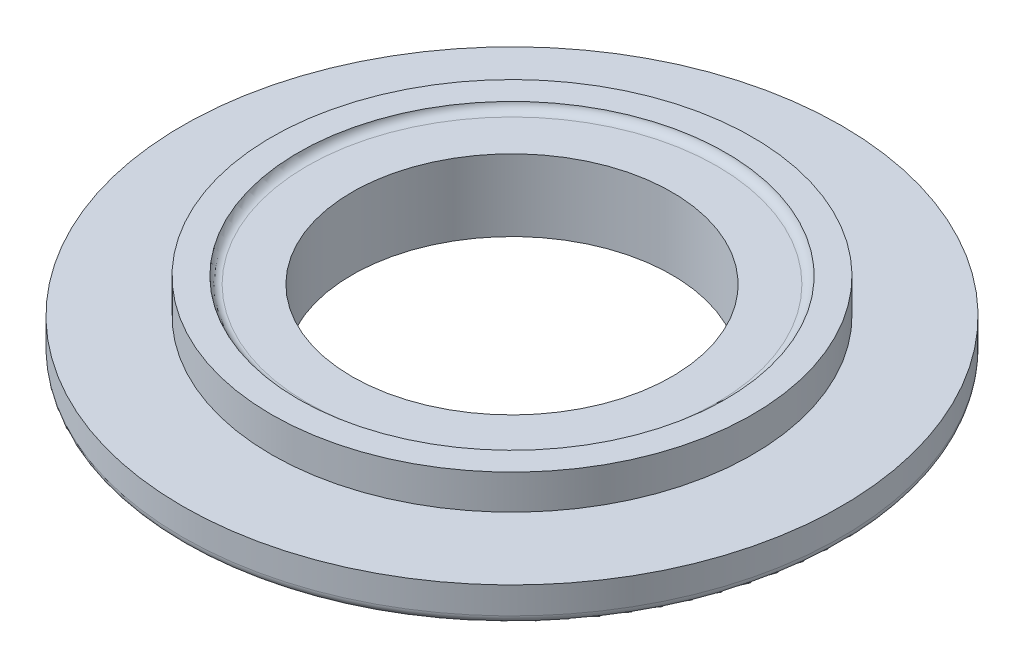
ISO-10303-21;
HEADER;
FILE_DESCRIPTION(('STEP AP214'),'2;1');
FILE_NAME('part.step','',(''),(''),'','','');
FILE_SCHEMA(('AUTOMOTIVE_DESIGN { 1 0 10303 214 1 1 1 1 }'));
ENDSEC;
DATA;
#1=APPLICATION_CONTEXT('core data for automotive mechanical design processes');
#2=APPLICATION_PROTOCOL_DEFINITION('international standard','automotive_design',2000,#1);
#3=PRODUCT_CONTEXT('',#1,'mechanical');
#4=PRODUCT('Part','Part','',(#3));
#5=PRODUCT_RELATED_PRODUCT_CATEGORY('part','',(#4));
#6=PRODUCT_DEFINITION_FORMATION('','',#4);
#7=PRODUCT_DEFINITION_CONTEXT('part definition',#1,'design');
#8=PRODUCT_DEFINITION('design','',#6,#7);
#9=PRODUCT_DEFINITION_SHAPE('','',#8);
#10=(LENGTH_UNIT() NAMED_UNIT(*) SI_UNIT(.MILLI.,.METRE.));
#11=(NAMED_UNIT(*) PLANE_ANGLE_UNIT() SI_UNIT($,.RADIAN.));
#12=(NAMED_UNIT(*) SI_UNIT($,.STERADIAN.) SOLID_ANGLE_UNIT());
#13=UNCERTAINTY_MEASURE_WITH_UNIT(LENGTH_MEASURE(1.E-05),#10,'distance_accuracy_value','');
#14=(GEOMETRIC_REPRESENTATION_CONTEXT(3) GLOBAL_UNCERTAINTY_ASSIGNED_CONTEXT((#13)) GLOBAL_UNIT_ASSIGNED_CONTEXT((#10,
#11,#12)) REPRESENTATION_CONTEXT('',''));
#15=CARTESIAN_POINT('',(0.,0.,0.));
#16=DIRECTION('',(0.,0.,1.));
#17=DIRECTION('',(1.,0.,0.));
#18=AXIS2_PLACEMENT_3D('',#15,#16,#17);
#19=CARTESIAN_POINT('',(0.,-0.827200395577673,0.));
#20=DIRECTION('',(0.,-1.,0.));
#21=DIRECTION('',(0.,0.,-1.));
#22=AXIS2_PLACEMENT_3D('',#19,#20,#21);
#23=PLANE('',#22);
#24=CARTESIAN_POINT('',(38.3060922527579,-0.827200395577673,0.));
#25=DIRECTION('',(0.,-1.,0.));
#26=DIRECTION('',(0.,0.,-1.));
#27=AXIS2_PLACEMENT_3D('',#24,#25,#26);
#28=CIRCLE('',#27,39.741899614486);
#29=CARTESIAN_POINT('',(38.3060922527579,-0.827200395577673,-39.741899614486));
#30=VERTEX_POINT('',#29);
#31=EDGE_CURVE('E51',#30,#30,#28,.F.);
#32=ORIENTED_EDGE('',*,*,#31,.T.);
#33=EDGE_LOOP('',(#32));
#34=FACE_BOUND('',#33,.T.);
#35=CARTESIAN_POINT('',(38.3060922527579,-0.827200395577673,0.));
#36=DIRECTION('',(0.,1.,0.));
#37=DIRECTION('',(0.,0.,1.));
#38=AXIS2_PLACEMENT_3D('',#35,#36,#37);
#39=CIRCLE('',#38,31.);
#40=CARTESIAN_POINT('',(38.3060922527579,-0.827200395577673,31.));
#41=VERTEX_POINT('',#40);
#42=EDGE_CURVE('E94',#41,#41,#39,.T.);
#43=ORIENTED_EDGE('',*,*,#42,.F.);
#44=EDGE_LOOP('',(#43));
#45=FACE_BOUND('',#44,.T.);
#46=ADVANCED_FACE('F38',(#34,#45),#23,.F.);
#47=CARTESIAN_POINT('',(0.,0.60267074625998,0.));
#48=DIRECTION('',(0.,-1.,0.));
#49=DIRECTION('',(0.,0.,-1.));
#50=AXIS2_PLACEMENT_3D('',#47,#48,#49);
#51=PLANE('',#50);
#52=CARTESIAN_POINT('',(38.3060922527579,0.60267074625998,0.));
#53=DIRECTION('',(0.,1.,0.));
#54=DIRECTION('',(0.,0.,1.));
#55=AXIS2_PLACEMENT_3D('',#52,#53,#54);
#56=CIRCLE('',#55,41.4203007584286);
#57=CARTESIAN_POINT('',(38.3060922527579,0.60267074625998,41.4203007584286));
#58=VERTEX_POINT('',#57);
#59=EDGE_CURVE('E56',#58,#58,#56,.T.);
#60=ORIENTED_EDGE('',*,*,#59,.F.);
#61=EDGE_LOOP('',(#60));
#62=FACE_BOUND('',#61,.T.);
#63=CARTESIAN_POINT('',(38.3060922527579,0.60267074625998,0.));
#64=DIRECTION('',(0.,1.,0.));
#65=DIRECTION('',(0.,0.,1.));
#66=AXIS2_PLACEMENT_3D('',#63,#64,#65);
#67=CIRCLE('',#66,46.6086903302396);
#68=CARTESIAN_POINT('',(38.3060922527579,0.60267074625998,46.6086903302396));
#69=VERTEX_POINT('',#68);
#70=EDGE_CURVE('E62',#69,#69,#67,.T.);
#71=ORIENTED_EDGE('',*,*,#70,.T.);
#72=EDGE_LOOP('',(#71));
#73=FACE_BOUND('',#72,.T.);
#74=ADVANCED_FACE('F102',(#62,#73),#51,.F.);
#75=CARTESIAN_POINT('',(38.3060922527579,0.60267074625998,0.));
#76=DIRECTION('',(0.,1.,0.));
#77=DIRECTION('',(0.,0.,1.));
#78=AXIS2_PLACEMENT_3D('',#75,#76,#77);
#79=CYLINDRICAL_SURFACE('',#78,46.6086903302396);
#80=ORIENTED_EDGE('',*,*,#70,.F.);
#81=EDGE_LOOP('',(#80));
#82=FACE_BOUND('',#81,.T.);
#83=CARTESIAN_POINT('',(38.3060922527579,-6.12065782810794,0.));
#84=DIRECTION('',(0.,1.,0.));
#85=DIRECTION('',(0.,0.,1.));
#86=AXIS2_PLACEMENT_3D('',#83,#84,#85);
#87=CIRCLE('',#86,46.6086903302396);
#88=CARTESIAN_POINT('',(38.3060922527579,-6.12065782810794,46.6086903302396));
#89=VERTEX_POINT('',#88);
#90=EDGE_CURVE('E66',#89,#89,#87,.T.);
#91=ORIENTED_EDGE('',*,*,#90,.T.);
#92=EDGE_LOOP('',(#91));
#93=FACE_BOUND('',#92,.T.);
#94=ADVANCED_FACE('F108',(#82,#93),#79,.T.);
#95=CARTESIAN_POINT('',(0.,-6.12065782810794,0.));
#96=DIRECTION('',(0.,-1.,0.));
#97=DIRECTION('',(0.,0.,-1.));
#98=AXIS2_PLACEMENT_3D('',#95,#96,#97);
#99=PLANE('',#98);
#100=ORIENTED_EDGE('',*,*,#90,.F.);
#101=EDGE_LOOP('',(#100));
#102=FACE_BOUND('',#101,.T.);
#103=CARTESIAN_POINT('',(38.3060922527579,-6.12065782810794,0.));
#104=DIRECTION('',(0.,1.,0.));
#105=DIRECTION('',(0.,0.,1.));
#106=AXIS2_PLACEMENT_3D('',#103,#104,#105);
#107=CIRCLE('',#106,63.8897044158775);
#108=CARTESIAN_POINT('',(38.3060922527579,-6.12065782810794,63.8897044158775));
#109=VERTEX_POINT('',#108);
#110=EDGE_CURVE('E70',#109,#109,#107,.T.);
#111=ORIENTED_EDGE('',*,*,#110,.T.);
#112=EDGE_LOOP('',(#111));
#113=FACE_BOUND('',#112,.T.);
#114=ADVANCED_FACE('F131',(#102,#113),#99,.F.);
#115=CARTESIAN_POINT('',(38.3060922527579,0.60267074625998,0.));
#116=DIRECTION('',(0.,1.,0.));
#117=DIRECTION('',(0.,0.,1.));
#118=AXIS2_PLACEMENT_3D('',#115,#116,#117);
#119=CYLINDRICAL_SURFACE('',#118,63.8897044158775);
#120=CARTESIAN_POINT('',(38.3060922527579,-11.3206578281079,0.));
#121=DIRECTION('',(0.,1.,0.));
#122=DIRECTION('',(0.,0.,1.));
#123=AXIS2_PLACEMENT_3D('',#120,#121,#122);
#124=CIRCLE('',#123,63.8897044158775);
#125=CARTESIAN_POINT('',(38.3060922527579,-11.3206578281079,63.8897044158775));
#126=VERTEX_POINT('',#125);
#127=EDGE_CURVE('E46',#126,#126,#124,.T.);
#128=ORIENTED_EDGE('',*,*,#127,.T.);
#129=EDGE_LOOP('',(#128));
#130=FACE_BOUND('',#129,.T.);
#131=ORIENTED_EDGE('',*,*,#110,.F.);
#132=EDGE_LOOP('',(#131));
#133=FACE_BOUND('',#132,.T.);
#134=ADVANCED_FACE('F136',(#130,#133),#119,.T.);
#135=CARTESIAN_POINT('',(0.,-13.0206578281079,0.));
#136=DIRECTION('',(0.,1.,0.));
#137=DIRECTION('',(0.,0.,1.));
#138=AXIS2_PLACEMENT_3D('',#135,#136,#137);
#139=PLANE('',#138);
#140=CARTESIAN_POINT('',(38.3060922527579,-13.0206578281079,0.));
#141=DIRECTION('',(0.,1.,0.));
#142=DIRECTION('',(0.,0.,1.));
#143=AXIS2_PLACEMENT_3D('',#140,#141,#142);
#144=CIRCLE('',#143,62.1897044158775);
#145=CARTESIAN_POINT('',(38.3060922527579,-13.0206578281079,62.1897044158775));
#146=VERTEX_POINT('',#145);
#147=EDGE_CURVE('E10',#146,#146,#144,.F.);
#148=ORIENTED_EDGE('',*,*,#147,.T.);
#149=EDGE_LOOP('',(#148));
#150=FACE_BOUND('',#149,.T.);
#151=CARTESIAN_POINT('',(38.3060922527579,-13.0206578281079,0.));
#152=DIRECTION('',(0.,1.,0.));
#153=DIRECTION('',(0.,0.,1.));
#154=AXIS2_PLACEMENT_3D('',#151,#152,#153);
#155=CIRCLE('',#154,39.8678692330049);
#156=CARTESIAN_POINT('',(38.3060922527579,-13.0206578281079,39.8678692330049));
#157=VERTEX_POINT('',#156);
#158=EDGE_CURVE('E74',#157,#157,#155,.T.);
#159=ORIENTED_EDGE('',*,*,#158,.T.);
#160=EDGE_LOOP('',(#159));
#161=FACE_BOUND('',#160,.T.);
#162=ADVANCED_FACE('F141',(#150,#161),#139,.F.);
#163=CARTESIAN_POINT('',(38.3060922527579,0.60267074625998,0.));
#164=DIRECTION('',(0.,1.,0.));
#165=DIRECTION('',(0.,0.,1.));
#166=AXIS2_PLACEMENT_3D('',#163,#164,#165);
#167=CYLINDRICAL_SURFACE('',#166,39.8678692330049);
#168=ORIENTED_EDGE('',*,*,#158,.F.);
#169=EDGE_LOOP('',(#168));
#170=FACE_BOUND('',#169,.T.);
#171=CARTESIAN_POINT('',(38.3060922527579,-6.12065782810795,0.));
#172=DIRECTION('',(0.,1.,0.));
#173=DIRECTION('',(0.,0.,1.));
#174=AXIS2_PLACEMENT_3D('',#171,#172,#173);
#175=CIRCLE('',#174,39.8678692330049);
#176=CARTESIAN_POINT('',(38.3060922527579,-6.12065782810795,39.8678692330049));
#177=VERTEX_POINT('',#176);
#178=EDGE_CURVE('E78',#177,#177,#175,.T.);
#179=ORIENTED_EDGE('',*,*,#178,.T.);
#180=EDGE_LOOP('',(#179));
#181=FACE_BOUND('',#180,.T.);
#182=ADVANCED_FACE('F146',(#170,#181),#167,.F.);
#183=CARTESIAN_POINT('',(0.,-6.12065782810795,0.));
#184=DIRECTION('',(0.,1.,0.));
#185=DIRECTION('',(0.,0.,1.));
#186=AXIS2_PLACEMENT_3D('',#183,#184,#185);
#187=PLANE('',#186);
#188=ORIENTED_EDGE('',*,*,#178,.F.);
#189=EDGE_LOOP('',(#188));
#190=FACE_BOUND('',#189,.T.);
#191=CARTESIAN_POINT('',(38.3060922527579,-6.12065782810795,0.));
#192=DIRECTION('',(0.,1.,0.));
#193=DIRECTION('',(0.,0.,1.));
#194=AXIS2_PLACEMENT_3D('',#191,#192,#193);
#195=CIRCLE('',#194,34.3526519716311);
#196=CARTESIAN_POINT('',(38.3060922527579,-6.12065782810795,34.3526519716311));
#197=VERTEX_POINT('',#196);
#198=EDGE_CURVE('E82',#197,#197,#195,.T.);
#199=ORIENTED_EDGE('',*,*,#198,.T.);
#200=EDGE_LOOP('',(#199));
#201=FACE_BOUND('',#200,.T.);
#202=ADVANCED_FACE('F151',(#190,#201),#187,.F.);
#203=CARTESIAN_POINT('',(38.3060922527579,0.60267074625998,0.));
#204=DIRECTION('',(0.,1.,0.));
#205=DIRECTION('',(0.,0.,1.));
#206=AXIS2_PLACEMENT_3D('',#203,#204,#205);
#207=CYLINDRICAL_SURFACE('',#206,34.3526519716311);
#208=ORIENTED_EDGE('',*,*,#198,.F.);
#209=EDGE_LOOP('',(#208));
#210=FACE_BOUND('',#209,.T.);
#211=CARTESIAN_POINT('',(38.3060922527579,-14.7206578281079,0.));
#212=DIRECTION('',(0.,1.,0.));
#213=DIRECTION('',(0.,0.,1.));
#214=AXIS2_PLACEMENT_3D('',#211,#212,#213);
#215=CIRCLE('',#214,34.3526519716311);
#216=CARTESIAN_POINT('',(38.3060922527579,-14.7206578281079,34.3526519716311));
#217=VERTEX_POINT('',#216);
#218=EDGE_CURVE('E86',#217,#217,#215,.T.);
#219=ORIENTED_EDGE('',*,*,#218,.T.);
#220=EDGE_LOOP('',(#219));
#221=FACE_BOUND('',#220,.T.);
#222=ADVANCED_FACE('F155',(#210,#221),#207,.T.);
#223=CARTESIAN_POINT('',(0.,-14.7206578281079,0.));
#224=DIRECTION('',(0.,1.,0.));
#225=DIRECTION('',(0.,0.,1.));
#226=AXIS2_PLACEMENT_3D('',#223,#224,#225);
#227=PLANE('',#226);
#228=ORIENTED_EDGE('',*,*,#218,.F.);
#229=EDGE_LOOP('',(#228));
#230=FACE_BOUND('',#229,.T.);
#231=CARTESIAN_POINT('',(38.3060922527579,-14.7206578281079,0.));
#232=DIRECTION('',(0.,1.,0.));
#233=DIRECTION('',(0.,0.,1.));
#234=AXIS2_PLACEMENT_3D('',#231,#232,#233);
#235=CIRCLE('',#234,31.);
#236=CARTESIAN_POINT('',(38.3060922527579,-14.7206578281079,31.));
#237=VERTEX_POINT('',#236);
#238=EDGE_CURVE('E90',#237,#237,#235,.T.);
#239=ORIENTED_EDGE('',*,*,#238,.T.);
#240=EDGE_LOOP('',(#239));
#241=FACE_BOUND('',#240,.T.);
#242=ADVANCED_FACE('F120',(#230,#241),#227,.F.);
#243=CARTESIAN_POINT('',(38.3060922527579,0.60267074625998,0.));
#244=DIRECTION('',(0.,1.,0.));
#245=DIRECTION('',(0.,0.,1.));
#246=AXIS2_PLACEMENT_3D('',#243,#244,#245);
#247=CYLINDRICAL_SURFACE('',#246,31.);
#248=ORIENTED_EDGE('',*,*,#238,.F.);
#249=EDGE_LOOP('',(#248));
#250=FACE_BOUND('',#249,.T.);
#251=ORIENTED_EDGE('',*,*,#42,.T.);
#252=EDGE_LOOP('',(#251));
#253=FACE_BOUND('',#252,.T.);
#254=ADVANCED_FACE('F99',(#250,#253),#247,.F.);
#255=CARTESIAN_POINT('',(38.3060922527579,0.872799604422327,0.));
#256=DIRECTION('',(0.,1.,0.));
#257=DIRECTION('',(0.,0.,1.));
#258=AXIS2_PLACEMENT_3D('',#255,#256,#257);
#259=TOROIDAL_SURFACE('',#258,39.741899614486,1.7);
#260=ORIENTED_EDGE('',*,*,#59,.T.);
#261=EDGE_LOOP('',(#260));
#262=FACE_BOUND('',#261,.T.);
#263=ORIENTED_EDGE('',*,*,#31,.F.);
#264=EDGE_LOOP('',(#263));
#265=FACE_BOUND('',#264,.T.);
#266=ADVANCED_FACE('F112',(#262,#265),#259,.F.);
#267=CARTESIAN_POINT('',(38.3060922527579,-11.3206578281079,0.));
#268=DIRECTION('',(0.,1.,0.));
#269=DIRECTION('',(0.,0.,1.));
#270=AXIS2_PLACEMENT_3D('',#267,#268,#269);
#271=TOROIDAL_SURFACE('',#270,62.1897044158775,1.7);
#272=ORIENTED_EDGE('',*,*,#147,.F.);
#273=EDGE_LOOP('',(#272));
#274=FACE_BOUND('',#273,.T.);
#275=ORIENTED_EDGE('',*,*,#127,.F.);
#276=EDGE_LOOP('',(#275));
#277=FACE_BOUND('',#276,.T.);
#278=ADVANCED_FACE('F40',(#274,#277),#271,.T.);
#279=CLOSED_SHELL('',(#46,#74,#94,#114,#134,#162,#182,#202,#222,#242,#254,#266,#278));
#280=MANIFOLD_SOLID_BREP('B2',#279);
#281=ADVANCED_BREP_SHAPE_REPRESENTATION('',(#18,#280),#14);
#282=SHAPE_DEFINITION_REPRESENTATION(#9,#281);
ENDSEC;
END-ISO-10303-21;
